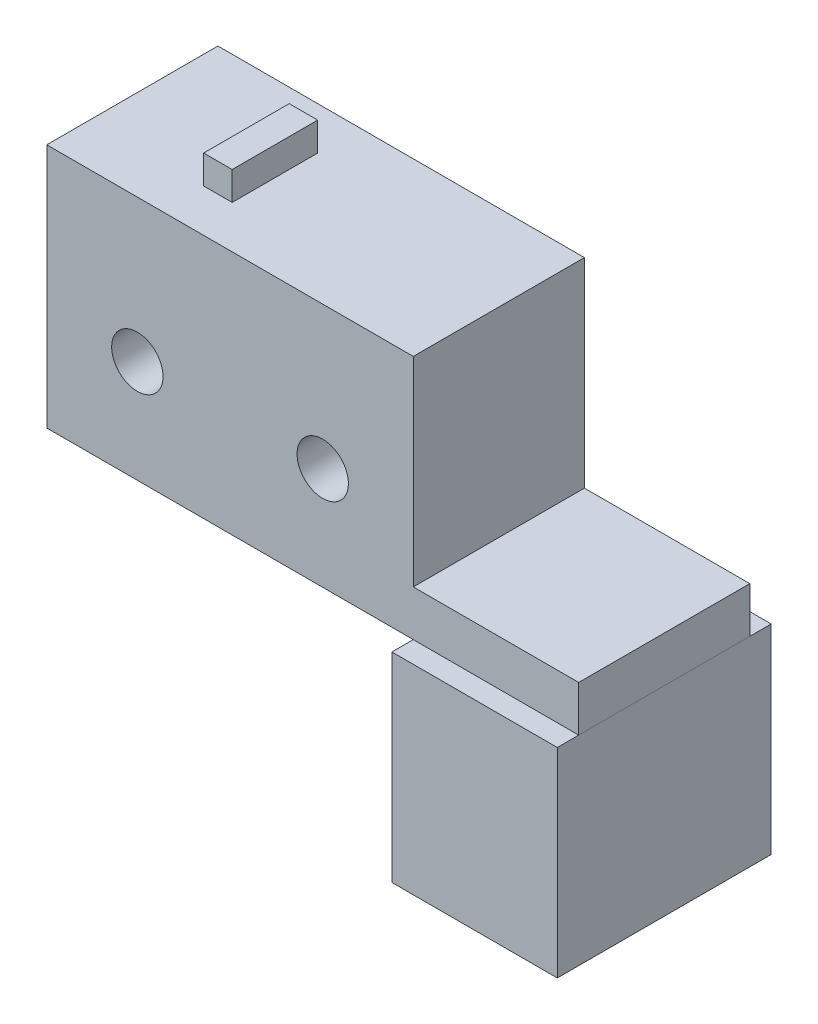
ISO-10303-21;
HEADER;
FILE_DESCRIPTION(('STEP AP214'),'2;1');
FILE_NAME('part.step','',(''),(''),'','','');
FILE_SCHEMA(('AUTOMOTIVE_DESIGN { 1 0 10303 214 1 1 1 1 }'));
ENDSEC;
DATA;
#1=APPLICATION_CONTEXT('core data for automotive mechanical design processes');
#2=APPLICATION_PROTOCOL_DEFINITION('international standard','automotive_design',2000,#1);
#3=PRODUCT_CONTEXT('',#1,'mechanical');
#4=PRODUCT('Part','Part','',(#3));
#5=PRODUCT_RELATED_PRODUCT_CATEGORY('part','',(#4));
#6=PRODUCT_DEFINITION_FORMATION('','',#4);
#7=PRODUCT_DEFINITION_CONTEXT('part definition',#1,'design');
#8=PRODUCT_DEFINITION('design','',#6,#7);
#9=PRODUCT_DEFINITION_SHAPE('','',#8);
#10=(LENGTH_UNIT() NAMED_UNIT(*) SI_UNIT(.MILLI.,.METRE.));
#11=(NAMED_UNIT(*) PLANE_ANGLE_UNIT() SI_UNIT($,.RADIAN.));
#12=(NAMED_UNIT(*) SI_UNIT($,.STERADIAN.) SOLID_ANGLE_UNIT());
#13=UNCERTAINTY_MEASURE_WITH_UNIT(LENGTH_MEASURE(1.E-05),#10,'distance_accuracy_value','');
#14=(GEOMETRIC_REPRESENTATION_CONTEXT(3) GLOBAL_UNCERTAINTY_ASSIGNED_CONTEXT((#13)) GLOBAL_UNIT_ASSIGNED_CONTEXT((#10,
#11,#12)) REPRESENTATION_CONTEXT('',''));
#15=CARTESIAN_POINT('',(0.,0.,0.));
#16=DIRECTION('',(0.,0.,1.));
#17=DIRECTION('',(1.,0.,0.));
#18=AXIS2_PLACEMENT_3D('',#15,#16,#17);
#19=CARTESIAN_POINT('',(12.8,4.4,8.35));
#20=DIRECTION('',(0.,0.,-1.));
#21=DIRECTION('',(-1.,0.,0.));
#22=AXIS2_PLACEMENT_3D('',#19,#20,#21);
#23=PLANE('',#22);
#24=DIRECTION('',(-1.,0.,0.));
#25=VECTOR('',#24,1.);
#26=CARTESIAN_POINT('',(12.8,11.4,8.35));
#27=LINE('',#26,#25);
#28=CARTESIAN_POINT('',(12.8,11.4,8.35));
#29=VERTEX_POINT('',#28);
#30=CARTESIAN_POINT('',(7.,11.4,8.35));
#31=VERTEX_POINT('',#30);
#32=EDGE_CURVE('E162',#29,#31,#27,.T.);
#33=ORIENTED_EDGE('',*,*,#32,.T.);
#34=DIRECTION('',(0.,1.,0.));
#35=VECTOR('',#34,1.);
#36=CARTESIAN_POINT('',(7.,4.4,8.35));
#37=LINE('',#36,#35);
#38=CARTESIAN_POINT('',(7.,4.4,8.35));
#39=VERTEX_POINT('',#38);
#40=EDGE_CURVE('E12',#39,#31,#37,.T.);
#41=ORIENTED_EDGE('',*,*,#40,.F.);
#42=DIRECTION('',(-1.,0.,0.));
#43=VECTOR('',#42,1.);
#44=CARTESIAN_POINT('',(12.8,4.4,8.35));
#45=LINE('',#44,#43);
#46=CARTESIAN_POINT('',(12.8,4.4,8.35));
#47=VERTEX_POINT('',#46);
#48=EDGE_CURVE('E155',#47,#39,#45,.T.);
#49=ORIENTED_EDGE('',*,*,#48,.F.);
#50=DIRECTION('',(0.,1.,0.));
#51=VECTOR('',#50,1.);
#52=CARTESIAN_POINT('',(12.8,4.4,8.35));
#53=LINE('',#52,#51);
#54=EDGE_CURVE('E161',#47,#29,#53,.T.);
#55=ORIENTED_EDGE('',*,*,#54,.T.);
#56=EDGE_LOOP('',(#33,#41,#49,#55));
#57=FACE_BOUND('',#56,.T.);
#58=ADVANCED_FACE('F48',(#57),#23,.F.);
#59=CARTESIAN_POINT('',(7.,4.4,8.35));
#60=DIRECTION('',(1.,0.,0.));
#61=DIRECTION('',(0.,0.,-1.));
#62=AXIS2_PLACEMENT_3D('',#59,#60,#61);
#63=PLANE('',#62);
#64=DIRECTION('',(0.,0.,-1.));
#65=VECTOR('',#64,1.);
#66=CARTESIAN_POINT('',(7.,11.4,8.35));
#67=LINE('',#66,#65);
#68=CARTESIAN_POINT('',(7.,11.4,0.849999999999999));
#69=VERTEX_POINT('',#68);
#70=EDGE_CURVE('E165',#31,#69,#67,.T.);
#71=ORIENTED_EDGE('',*,*,#70,.T.);
#72=DIRECTION('',(0.,1.,0.));
#73=VECTOR('',#72,1.);
#74=CARTESIAN_POINT('',(7.,4.4,0.849999999999999));
#75=LINE('',#74,#73);
#76=CARTESIAN_POINT('',(7.,4.4,0.849999999999999));
#77=VERTEX_POINT('',#76);
#78=EDGE_CURVE('E55',#77,#69,#75,.T.);
#79=ORIENTED_EDGE('',*,*,#78,.F.);
#80=DIRECTION('',(0.,0.,-1.));
#81=VECTOR('',#80,1.);
#82=CARTESIAN_POINT('',(7.,4.4,8.35));
#83=LINE('',#82,#81);
#84=EDGE_CURVE('E99',#39,#77,#83,.T.);
#85=ORIENTED_EDGE('',*,*,#84,.F.);
#86=ORIENTED_EDGE('',*,*,#40,.T.);
#87=EDGE_LOOP('',(#71,#79,#85,#86));
#88=FACE_BOUND('',#87,.T.);
#89=ADVANCED_FACE('F194',(#88),#63,.F.);
#90=CARTESIAN_POINT('',(7.,4.4,0.849999999999999));
#91=DIRECTION('',(0.,0.,1.));
#92=DIRECTION('',(1.,0.,0.));
#93=AXIS2_PLACEMENT_3D('',#90,#91,#92);
#94=PLANE('',#93);
#95=DIRECTION('',(1.,0.,0.));
#96=VECTOR('',#95,1.);
#97=CARTESIAN_POINT('',(7.,11.4,0.849999999999999));
#98=LINE('',#97,#96);
#99=CARTESIAN_POINT('',(12.8,11.4,0.849999999999999));
#100=VERTEX_POINT('',#99);
#101=EDGE_CURVE('E167',#69,#100,#98,.T.);
#102=ORIENTED_EDGE('',*,*,#101,.T.);
#103=DIRECTION('',(0.,1.,0.));
#104=VECTOR('',#103,1.);
#105=CARTESIAN_POINT('',(12.8,4.4,0.849999999999999));
#106=LINE('',#105,#104);
#107=CARTESIAN_POINT('',(12.8,4.4,0.849999999999999));
#108=VERTEX_POINT('',#107);
#109=EDGE_CURVE('E171',#108,#100,#106,.T.);
#110=ORIENTED_EDGE('',*,*,#109,.F.);
#111=DIRECTION('',(1.,0.,0.));
#112=VECTOR('',#111,1.);
#113=CARTESIAN_POINT('',(7.,4.4,0.849999999999999));
#114=LINE('',#113,#112);
#115=EDGE_CURVE('E158',#77,#108,#114,.T.);
#116=ORIENTED_EDGE('',*,*,#115,.F.);
#117=ORIENTED_EDGE('',*,*,#78,.T.);
#118=EDGE_LOOP('',(#102,#110,#116,#117));
#119=FACE_BOUND('',#118,.T.);
#120=ADVANCED_FACE('F176',(#119),#94,.F.);
#121=CARTESIAN_POINT('',(12.8,4.4,0.849999999999999));
#122=DIRECTION('',(-1.,0.,0.));
#123=DIRECTION('',(0.,0.,1.));
#124=AXIS2_PLACEMENT_3D('',#121,#122,#123);
#125=PLANE('',#124);
#126=DIRECTION('',(0.,0.,1.));
#127=VECTOR('',#126,1.);
#128=CARTESIAN_POINT('',(12.8,11.4,0.849999999999999));
#129=LINE('',#128,#127);
#130=EDGE_CURVE('E92',#100,#29,#129,.T.);
#131=ORIENTED_EDGE('',*,*,#130,.T.);
#132=ORIENTED_EDGE('',*,*,#54,.F.);
#133=DIRECTION('',(0.,0.,1.));
#134=VECTOR('',#133,1.);
#135=CARTESIAN_POINT('',(12.8,4.4,0.849999999999999));
#136=LINE('',#135,#134);
#137=EDGE_CURVE('E71',#108,#47,#136,.T.);
#138=ORIENTED_EDGE('',*,*,#137,.F.);
#139=ORIENTED_EDGE('',*,*,#109,.T.);
#140=EDGE_LOOP('',(#131,#132,#138,#139));
#141=FACE_BOUND('',#140,.T.);
#142=ADVANCED_FACE('F184',(#141),#125,.F.);
#143=CARTESIAN_POINT('',(0.,4.4,0.));
#144=DIRECTION('',(0.,-1.,0.));
#145=DIRECTION('',(0.,0.,-1.));
#146=AXIS2_PLACEMENT_3D('',#143,#144,#145);
#147=PLANE('',#146);
#148=DIRECTION('',(-1.,0.,0.));
#149=VECTOR('',#148,1.);
#150=CARTESIAN_POINT('',(12.8,4.4,7.85));
#151=LINE('',#150,#149);
#152=CARTESIAN_POINT('',(12.3,4.4,7.85));
#153=VERTEX_POINT('',#152);
#154=CARTESIAN_POINT('',(7.5,4.4,7.85));
#155=VERTEX_POINT('',#154);
#156=EDGE_CURVE('E144',#153,#155,#151,.T.);
#157=ORIENTED_EDGE('',*,*,#156,.F.);
#158=DIRECTION('',(0.,0.,1.));
#159=VECTOR('',#158,1.);
#160=CARTESIAN_POINT('',(12.3,4.4,0.849999999999999));
#161=LINE('',#160,#159);
#162=CARTESIAN_POINT('',(12.3,4.4,1.35));
#163=VERTEX_POINT('',#162);
#164=EDGE_CURVE('E153',#163,#153,#161,.T.);
#165=ORIENTED_EDGE('',*,*,#164,.F.);
#166=DIRECTION('',(1.,0.,0.));
#167=VECTOR('',#166,1.);
#168=CARTESIAN_POINT('',(7.,4.4,1.35));
#169=LINE('',#168,#167);
#170=CARTESIAN_POINT('',(7.5,4.4,1.35));
#171=VERTEX_POINT('',#170);
#172=EDGE_CURVE('E151',#171,#163,#169,.T.);
#173=ORIENTED_EDGE('',*,*,#172,.F.);
#174=DIRECTION('',(0.,0.,-1.));
#175=VECTOR('',#174,1.);
#176=CARTESIAN_POINT('',(7.5,4.4,8.35));
#177=LINE('',#176,#175);
#178=EDGE_CURVE('E136',#155,#171,#177,.T.);
#179=ORIENTED_EDGE('',*,*,#178,.F.);
#180=EDGE_LOOP('',(#157,#165,#173,#179));
#181=FACE_BOUND('',#180,.T.);
#182=ORIENTED_EDGE('',*,*,#48,.T.);
#183=ORIENTED_EDGE('',*,*,#84,.T.);
#184=ORIENTED_EDGE('',*,*,#115,.T.);
#185=ORIENTED_EDGE('',*,*,#137,.T.);
#186=EDGE_LOOP('',(#182,#183,#184,#185));
#187=FACE_BOUND('',#186,.T.);
#188=ADVANCED_FACE('F186',(#181,#187),#147,.T.);
#189=CARTESIAN_POINT('',(0.,11.4,0.));
#190=DIRECTION('',(0.,-1.,0.));
#191=DIRECTION('',(0.,0.,-1.));
#192=AXIS2_PLACEMENT_3D('',#189,#190,#191);
#193=PLANE('',#192);
#194=ORIENTED_EDGE('',*,*,#32,.F.);
#195=ORIENTED_EDGE('',*,*,#130,.F.);
#196=ORIENTED_EDGE('',*,*,#101,.F.);
#197=ORIENTED_EDGE('',*,*,#70,.F.);
#198=EDGE_LOOP('',(#194,#195,#196,#197));
#199=FACE_BOUND('',#198,.T.);
#200=ADVANCED_FACE('F180',(#199),#193,.F.);
#201=CARTESIAN_POINT('',(12.8,4.4,7.85));
#202=DIRECTION('',(0.,0.,-1.));
#203=DIRECTION('',(-1.,0.,0.));
#204=AXIS2_PLACEMENT_3D('',#201,#202,#203);
#205=PLANE('',#204);
#206=DIRECTION('',(-1.,0.,0.));
#207=VECTOR('',#206,1.);
#208=CARTESIAN_POINT('',(12.8,10.9,7.85));
#209=LINE('',#208,#207);
#210=CARTESIAN_POINT('',(12.3,10.9,7.85));
#211=VERTEX_POINT('',#210);
#212=CARTESIAN_POINT('',(7.5,10.9,7.85));
#213=VERTEX_POINT('',#212);
#214=EDGE_CURVE('E127',#211,#213,#209,.T.);
#215=ORIENTED_EDGE('',*,*,#214,.F.);
#216=DIRECTION('',(0.,1.,0.));
#217=VECTOR('',#216,1.);
#218=CARTESIAN_POINT('',(12.3,4.4,7.85));
#219=LINE('',#218,#217);
#220=EDGE_CURVE('E147',#153,#211,#219,.T.);
#221=ORIENTED_EDGE('',*,*,#220,.F.);
#222=ORIENTED_EDGE('',*,*,#156,.T.);
#223=DIRECTION('',(0.,1.,0.));
#224=VECTOR('',#223,1.);
#225=CARTESIAN_POINT('',(7.5,4.4,7.85));
#226=LINE('',#225,#224);
#227=EDGE_CURVE('E139',#155,#213,#226,.T.);
#228=ORIENTED_EDGE('',*,*,#227,.T.);
#229=EDGE_LOOP('',(#215,#221,#222,#228));
#230=FACE_BOUND('',#229,.T.);
#231=ADVANCED_FACE('F221',(#230),#205,.T.);
#232=CARTESIAN_POINT('',(7.5,4.4,8.35));
#233=DIRECTION('',(1.,0.,0.));
#234=DIRECTION('',(0.,0.,-1.));
#235=AXIS2_PLACEMENT_3D('',#232,#233,#234);
#236=PLANE('',#235);
#237=DIRECTION('',(0.,0.,-1.));
#238=VECTOR('',#237,1.);
#239=CARTESIAN_POINT('',(7.5,10.9,8.35));
#240=LINE('',#239,#238);
#241=CARTESIAN_POINT('',(7.5,10.9,1.35));
#242=VERTEX_POINT('',#241);
#243=EDGE_CURVE('E121',#213,#242,#240,.T.);
#244=ORIENTED_EDGE('',*,*,#243,.F.);
#245=ORIENTED_EDGE('',*,*,#227,.F.);
#246=ORIENTED_EDGE('',*,*,#178,.T.);
#247=DIRECTION('',(0.,1.,0.));
#248=VECTOR('',#247,1.);
#249=CARTESIAN_POINT('',(7.5,4.4,1.35));
#250=LINE('',#249,#248);
#251=EDGE_CURVE('E133',#171,#242,#250,.T.);
#252=ORIENTED_EDGE('',*,*,#251,.T.);
#253=EDGE_LOOP('',(#244,#245,#246,#252));
#254=FACE_BOUND('',#253,.T.);
#255=ADVANCED_FACE('F134',(#254),#236,.T.);
#256=CARTESIAN_POINT('',(7.,4.4,1.35));
#257=DIRECTION('',(0.,0.,1.));
#258=DIRECTION('',(1.,0.,0.));
#259=AXIS2_PLACEMENT_3D('',#256,#257,#258);
#260=PLANE('',#259);
#261=DIRECTION('',(1.,0.,0.));
#262=VECTOR('',#261,1.);
#263=CARTESIAN_POINT('',(7.,10.9,1.35));
#264=LINE('',#263,#262);
#265=CARTESIAN_POINT('',(12.3,10.9,1.35));
#266=VERTEX_POINT('',#265);
#267=EDGE_CURVE('E125',#242,#266,#264,.T.);
#268=ORIENTED_EDGE('',*,*,#267,.F.);
#269=ORIENTED_EDGE('',*,*,#251,.F.);
#270=ORIENTED_EDGE('',*,*,#172,.T.);
#271=DIRECTION('',(0.,1.,0.));
#272=VECTOR('',#271,1.);
#273=CARTESIAN_POINT('',(12.3,4.4,1.35));
#274=LINE('',#273,#272);
#275=EDGE_CURVE('E62',#163,#266,#274,.T.);
#276=ORIENTED_EDGE('',*,*,#275,.T.);
#277=EDGE_LOOP('',(#268,#269,#270,#276));
#278=FACE_BOUND('',#277,.T.);
#279=ADVANCED_FACE('F141',(#278),#260,.T.);
#280=CARTESIAN_POINT('',(12.3,4.4,0.849999999999999));
#281=DIRECTION('',(-1.,0.,0.));
#282=DIRECTION('',(0.,0.,1.));
#283=AXIS2_PLACEMENT_3D('',#280,#281,#282);
#284=PLANE('',#283);
#285=DIRECTION('',(0.,0.,1.));
#286=VECTOR('',#285,1.);
#287=CARTESIAN_POINT('',(12.3,10.9,0.849999999999999));
#288=LINE('',#287,#286);
#289=EDGE_CURVE('E142',#266,#211,#288,.T.);
#290=ORIENTED_EDGE('',*,*,#289,.F.);
#291=ORIENTED_EDGE('',*,*,#275,.F.);
#292=ORIENTED_EDGE('',*,*,#164,.T.);
#293=ORIENTED_EDGE('',*,*,#220,.T.);
#294=EDGE_LOOP('',(#290,#291,#292,#293));
#295=FACE_BOUND('',#294,.T.);
#296=ADVANCED_FACE('F251',(#295),#284,.T.);
#297=CARTESIAN_POINT('',(0.,10.9,0.));
#298=DIRECTION('',(0.,-1.,0.));
#299=DIRECTION('',(0.,0.,-1.));
#300=AXIS2_PLACEMENT_3D('',#297,#298,#299);
#301=PLANE('',#300);
#302=ORIENTED_EDGE('',*,*,#214,.T.);
#303=ORIENTED_EDGE('',*,*,#243,.T.);
#304=ORIENTED_EDGE('',*,*,#267,.T.);
#305=ORIENTED_EDGE('',*,*,#289,.T.);
#306=EDGE_LOOP('',(#302,#303,#304,#305));
#307=FACE_BOUND('',#306,.T.);
#308=ADVANCED_FACE('F123',(#307),#301,.T.);
#309=CLOSED_SHELL('',(#58,#89,#120,#142,#188,#200,#231,#255,#279,#296,#308));
#310=MANIFOLD_SOLID_BREP('B2',#309);
#311=CARTESIAN_POINT('',(-7.,20.,1.6));
#312=DIRECTION('',(0.,-1.,0.));
#313=DIRECTION('',(0.,0.,-1.));
#314=AXIS2_PLACEMENT_3D('',#311,#312,#313);
#315=PLANE('',#314);
#316=DIRECTION('',(0.,0.,-1.));
#317=VECTOR('',#316,1.);
#318=CARTESIAN_POINT('',(7.,20.,7.6));
#319=LINE('',#318,#317);
#320=CARTESIAN_POINT('',(7.,20.,7.6));
#321=VERTEX_POINT('',#320);
#322=CARTESIAN_POINT('',(7.,20.,1.6));
#323=VERTEX_POINT('',#322);
#324=EDGE_CURVE('E589',#321,#323,#319,.T.);
#325=ORIENTED_EDGE('',*,*,#324,.T.);
#326=DIRECTION('',(-1.,0.,0.));
#327=VECTOR('',#326,1.);
#328=CARTESIAN_POINT('',(-7.,20.,1.6));
#329=LINE('',#328,#327);
#330=CARTESIAN_POINT('',(-5.84999999999999,20.,1.6));
#331=VERTEX_POINT('',#330);
#332=EDGE_CURVE('E533',#323,#331,#329,.T.);
#333=ORIENTED_EDGE('',*,*,#332,.T.);
#334=DIRECTION('',(0.,0.,-1.));
#335=VECTOR('',#334,1.);
#336=CARTESIAN_POINT('',(-5.84999999999999,20.,7.6));
#337=LINE('',#336,#335);
#338=CARTESIAN_POINT('',(-5.84999999999999,20.,7.6));
#339=VERTEX_POINT('',#338);
#340=EDGE_CURVE('E594',#339,#331,#337,.T.);
#341=ORIENTED_EDGE('',*,*,#340,.F.);
#342=DIRECTION('',(-1.,0.,0.));
#343=VECTOR('',#342,1.);
#344=CARTESIAN_POINT('',(0.,20.,7.6));
#345=LINE('',#344,#343);
#346=EDGE_CURVE('E581',#321,#339,#345,.T.);
#347=ORIENTED_EDGE('',*,*,#346,.F.);
#348=EDGE_LOOP('',(#325,#333,#341,#347));
#349=FACE_BOUND('',#348,.T.);
#350=DIRECTION('',(-1.,0.,0.));
#351=VECTOR('',#350,1.);
#352=CARTESIAN_POINT('',(-0.849999999999986,20.,3.1));
#353=LINE('',#352,#351);
#354=CARTESIAN_POINT('',(-0.849999999999986,20.,3.1));
#355=VERTEX_POINT('',#354);
#356=CARTESIAN_POINT('',(-1.84999999999999,20.,3.1));
#357=VERTEX_POINT('',#356);
#358=EDGE_CURVE('E454',#355,#357,#353,.T.);
#359=ORIENTED_EDGE('',*,*,#358,.F.);
#360=DIRECTION('',(0.,0.,-1.));
#361=VECTOR('',#360,1.);
#362=CARTESIAN_POINT('',(-0.849999999999986,20.,6.1));
#363=LINE('',#362,#361);
#364=CARTESIAN_POINT('',(-0.849999999999987,20.,6.1));
#365=VERTEX_POINT('',#364);
#366=EDGE_CURVE('E451',#365,#355,#363,.T.);
#367=ORIENTED_EDGE('',*,*,#366,.F.);
#368=DIRECTION('',(1.,0.,0.));
#369=VECTOR('',#368,1.);
#370=CARTESIAN_POINT('',(-1.84999999999999,20.,6.1));
#371=LINE('',#370,#369);
#372=CARTESIAN_POINT('',(-1.84999999999999,20.,6.1));
#373=VERTEX_POINT('',#372);
#374=EDGE_CURVE('E305',#373,#365,#371,.T.);
#375=ORIENTED_EDGE('',*,*,#374,.F.);
#376=DIRECTION('',(0.,0.,1.));
#377=VECTOR('',#376,1.);
#378=CARTESIAN_POINT('',(-1.84999999999999,20.,3.1));
#379=LINE('',#378,#377);
#380=EDGE_CURVE('E300',#357,#373,#379,.T.);
#381=ORIENTED_EDGE('',*,*,#380,.F.);
#382=EDGE_LOOP('',(#359,#367,#375,#381));
#383=FACE_BOUND('',#382,.T.);
#384=ADVANCED_FACE('F286',(#349,#383),#315,.F.);
#385=CARTESIAN_POINT('',(7.,0.,7.6));
#386=DIRECTION('',(1.,0.,0.));
#387=DIRECTION('',(0.,1.,0.));
#388=AXIS2_PLACEMENT_3D('',#385,#386,#387);
#389=PLANE('',#388);
#390=DIRECTION('',(0.,0.,1.));
#391=VECTOR('',#390,1.);
#392=CARTESIAN_POINT('',(7.,13.,4.6));
#393=LINE('',#392,#391);
#394=CARTESIAN_POINT('',(7.00000000000001,13.,1.6));
#395=VERTEX_POINT('',#394);
#396=CARTESIAN_POINT('',(7.00000000000002,13.,7.6));
#397=VERTEX_POINT('',#396);
#398=EDGE_CURVE('E578',#395,#397,#393,.T.);
#399=ORIENTED_EDGE('',*,*,#398,.F.);
#400=DIRECTION('',(0.,-1.,0.));
#401=VECTOR('',#400,1.);
#402=CARTESIAN_POINT('',(7.,0.,1.6));
#403=LINE('',#402,#401);
#404=EDGE_CURVE('E584',#323,#395,#403,.T.);
#405=ORIENTED_EDGE('',*,*,#404,.F.);
#406=ORIENTED_EDGE('',*,*,#324,.F.);
#407=DIRECTION('',(0.,-1.,0.));
#408=VECTOR('',#407,1.);
#409=CARTESIAN_POINT('',(7.,0.,7.6));
#410=LINE('',#409,#408);
#411=EDGE_CURVE('E586',#321,#397,#410,.T.);
#412=ORIENTED_EDGE('',*,*,#411,.T.);
#413=EDGE_LOOP('',(#399,#405,#406,#412));
#414=FACE_BOUND('',#413,.T.);
#415=ADVANCED_FACE('F628',(#414),#389,.T.);
#416=CARTESIAN_POINT('',(0.,0.,7.6));
#417=DIRECTION('',(0.,0.,1.));
#418=DIRECTION('',(1.,0.,0.));
#419=AXIS2_PLACEMENT_3D('',#416,#417,#418);
#420=PLANE('',#419);
#421=CARTESIAN_POINT('',(3.82500000000001,15.,7.6));
#422=DIRECTION('',(0.,0.,1.));
#423=DIRECTION('',(1.,0.,0.));
#424=AXIS2_PLACEMENT_3D('',#421,#422,#423);
#425=CIRCLE('',#424,0.899999999999999);
#426=CARTESIAN_POINT('',(4.725,15.,7.6));
#427=VERTEX_POINT('',#426);
#428=EDGE_CURVE('E510',#427,#427,#425,.T.);
#429=ORIENTED_EDGE('',*,*,#428,.F.);
#430=EDGE_LOOP('',(#429));
#431=FACE_BOUND('',#430,.T.);
#432=CARTESIAN_POINT('',(-2.67499999999999,15.,7.6));
#433=DIRECTION('',(0.,0.,1.));
#434=DIRECTION('',(1.,0.,0.));
#435=AXIS2_PLACEMENT_3D('',#432,#433,#434);
#436=CIRCLE('',#435,0.9);
#437=CARTESIAN_POINT('',(-1.77499999999999,15.,7.6));
#438=VERTEX_POINT('',#437);
#439=EDGE_CURVE('E514',#438,#438,#436,.T.);
#440=ORIENTED_EDGE('',*,*,#439,.F.);
#441=EDGE_LOOP('',(#440));
#442=FACE_BOUND('',#441,.T.);
#443=ORIENTED_EDGE('',*,*,#346,.T.);
#444=DIRECTION('',(0.,-1.,0.));
#445=VECTOR('',#444,1.);
#446=CARTESIAN_POINT('',(-5.84999999999999,0.,7.6));
#447=LINE('',#446,#445);
#448=CARTESIAN_POINT('',(-5.84999999999999,11.4,7.6));
#449=VERTEX_POINT('',#448);
#450=EDGE_CURVE('E583',#339,#449,#447,.T.);
#451=ORIENTED_EDGE('',*,*,#450,.T.);
#452=DIRECTION('',(-1.,0.,0.));
#453=VECTOR('',#452,1.);
#454=CARTESIAN_POINT('',(-5.84999999999999,11.4,7.6));
#455=LINE('',#454,#453);
#456=CARTESIAN_POINT('',(12.8,11.4,7.6));
#457=VERTEX_POINT('',#456);
#458=EDGE_CURVE('E464',#457,#449,#455,.T.);
#459=ORIENTED_EDGE('',*,*,#458,.F.);
#460=DIRECTION('',(0.,1.,0.));
#461=VECTOR('',#460,1.);
#462=CARTESIAN_POINT('',(12.8,11.4,7.6));
#463=LINE('',#462,#461);
#464=CARTESIAN_POINT('',(12.8,13.,7.6));
#465=VERTEX_POINT('',#464);
#466=EDGE_CURVE('E474',#457,#465,#463,.T.);
#467=ORIENTED_EDGE('',*,*,#466,.T.);
#468=DIRECTION('',(-1.,0.,0.));
#469=VECTOR('',#468,1.);
#470=CARTESIAN_POINT('',(-5.84999999999999,13.,7.6));
#471=LINE('',#470,#469);
#472=EDGE_CURVE('E455',#465,#397,#471,.T.);
#473=ORIENTED_EDGE('',*,*,#472,.T.);
#474=ORIENTED_EDGE('',*,*,#411,.F.);
#475=EDGE_LOOP('',(#443,#451,#459,#467,#473,#474));
#476=FACE_BOUND('',#475,.T.);
#477=ADVANCED_FACE('F633',(#431,#442,#476),#420,.T.);
#478=CARTESIAN_POINT('',(-5.84999999999999,0.,7.6));
#479=DIRECTION('',(1.,0.,0.));
#480=DIRECTION('',(0.,0.,-1.));
#481=AXIS2_PLACEMENT_3D('',#478,#479,#480);
#482=PLANE('',#481);
#483=DIRECTION('',(0.,-1.,0.));
#484=VECTOR('',#483,1.);
#485=CARTESIAN_POINT('',(-5.84999999999999,10.,4.6));
#486=LINE('',#485,#484);
#487=CARTESIAN_POINT('',(-5.84999999999999,11.4,4.6));
#488=VERTEX_POINT('',#487);
#489=CARTESIAN_POINT('',(-5.84999999999999,10.75,4.6));
#490=VERTEX_POINT('',#489);
#491=EDGE_CURVE('E573',#488,#490,#486,.T.);
#492=ORIENTED_EDGE('',*,*,#491,.F.);
#493=DIRECTION('',(0.,0.,-1.));
#494=VECTOR('',#493,1.);
#495=CARTESIAN_POINT('',(-5.84999999999999,11.4,1.6));
#496=LINE('',#495,#494);
#497=EDGE_CURVE('E469',#449,#488,#496,.T.);
#498=ORIENTED_EDGE('',*,*,#497,.F.);
#499=ORIENTED_EDGE('',*,*,#450,.F.);
#500=ORIENTED_EDGE('',*,*,#340,.T.);
#501=DIRECTION('',(0.,-1.,0.));
#502=VECTOR('',#501,1.);
#503=CARTESIAN_POINT('',(-5.84999999999999,0.,1.6));
#504=LINE('',#503,#502);
#505=CARTESIAN_POINT('',(-5.84999999999999,11.4,1.6));
#506=VERTEX_POINT('',#505);
#507=EDGE_CURVE('E580',#331,#506,#504,.T.);
#508=ORIENTED_EDGE('',*,*,#507,.T.);
#509=CARTESIAN_POINT('',(-5.84999999999999,11.4,3.85));
#510=VERTEX_POINT('',#509);
#511=EDGE_CURVE('E467',#510,#506,#496,.T.);
#512=ORIENTED_EDGE('',*,*,#511,.F.);
#513=DIRECTION('',(0.,-1.,0.));
#514=VECTOR('',#513,1.);
#515=CARTESIAN_POINT('',(-5.84999999999999,0.,3.85));
#516=LINE('',#515,#514);
#517=CARTESIAN_POINT('',(-5.84999999999999,10.75,3.85));
#518=VERTEX_POINT('',#517);
#519=EDGE_CURVE('E563',#510,#518,#516,.T.);
#520=ORIENTED_EDGE('',*,*,#519,.T.);
#521=DIRECTION('',(0.,0.,1.));
#522=VECTOR('',#521,1.);
#523=CARTESIAN_POINT('',(-5.84999999999999,10.75,7.6));
#524=LINE('',#523,#522);
#525=EDGE_CURVE('E520',#518,#490,#524,.T.);
#526=ORIENTED_EDGE('',*,*,#525,.T.);
#527=EDGE_LOOP('',(#492,#498,#499,#500,#508,#512,#520,#526));
#528=FACE_BOUND('',#527,.T.);
#529=ADVANCED_FACE('F695',(#528),#482,.F.);
#530=CARTESIAN_POINT('',(-5.84999999999999,13.,4.6));
#531=DIRECTION('',(0.,0.,-1.));
#532=DIRECTION('',(-1.,0.,0.));
#533=AXIS2_PLACEMENT_3D('',#530,#531,#532);
#534=PLANE('',#533);
#535=DIRECTION('',(0.,-1.,0.));
#536=VECTOR('',#535,1.);
#537=CARTESIAN_POINT('',(-3.84999999999999,0.,4.6));
#538=LINE('',#537,#536);
#539=CARTESIAN_POINT('',(-3.84999999999999,11.4,4.6));
#540=VERTEX_POINT('',#539);
#541=CARTESIAN_POINT('',(-3.84999999999999,10.75,4.6));
#542=VERTEX_POINT('',#541);
#543=EDGE_CURVE('E567',#540,#542,#538,.T.);
#544=ORIENTED_EDGE('',*,*,#543,.F.);
#545=DIRECTION('',(-1.,0.,0.));
#546=VECTOR('',#545,1.);
#547=CARTESIAN_POINT('',(-5.84999999999999,11.4,4.6));
#548=LINE('',#547,#546);
#549=EDGE_CURVE('E507',#540,#488,#548,.T.);
#550=ORIENTED_EDGE('',*,*,#549,.T.);
#551=ORIENTED_EDGE('',*,*,#491,.T.);
#552=DIRECTION('',(1.,0.,0.));
#553=VECTOR('',#552,1.);
#554=CARTESIAN_POINT('',(-5.84999999999999,10.75,4.6));
#555=LINE('',#554,#553);
#556=EDGE_CURVE('E536',#490,#542,#555,.T.);
#557=ORIENTED_EDGE('',*,*,#556,.T.);
#558=EDGE_LOOP('',(#544,#550,#551,#557));
#559=FACE_BOUND('',#558,.T.);
#560=ADVANCED_FACE('F730',(#559),#534,.F.);
#561=CARTESIAN_POINT('',(-3.84999999999999,0.,1.6));
#562=DIRECTION('',(-1.,0.,0.));
#563=DIRECTION('',(0.,-1.,0.));
#564=AXIS2_PLACEMENT_3D('',#561,#562,#563);
#565=PLANE('',#564);
#566=DIRECTION('',(0.,1.,0.));
#567=VECTOR('',#566,1.);
#568=CARTESIAN_POINT('',(-3.84999999999999,0.,3.85));
#569=LINE('',#568,#567);
#570=CARTESIAN_POINT('',(-3.84999999999999,10.75,3.85));
#571=VERTEX_POINT('',#570);
#572=CARTESIAN_POINT('',(-3.84999999999999,11.4,3.85));
#573=VERTEX_POINT('',#572);
#574=EDGE_CURVE('E293',#571,#573,#569,.T.);
#575=ORIENTED_EDGE('',*,*,#574,.T.);
#576=DIRECTION('',(0.,0.,1.));
#577=VECTOR('',#576,1.);
#578=CARTESIAN_POINT('',(-3.84999999999999,11.4,1.6));
#579=LINE('',#578,#577);
#580=EDGE_CURVE('E504',#573,#540,#579,.T.);
#581=ORIENTED_EDGE('',*,*,#580,.T.);
#582=ORIENTED_EDGE('',*,*,#543,.T.);
#583=DIRECTION('',(0.,0.,-1.));
#584=VECTOR('',#583,1.);
#585=CARTESIAN_POINT('',(-3.84999999999999,10.75,1.6));
#586=LINE('',#585,#584);
#587=EDGE_CURVE('E529',#542,#571,#586,.T.);
#588=ORIENTED_EDGE('',*,*,#587,.T.);
#589=EDGE_LOOP('',(#575,#581,#582,#588));
#590=FACE_BOUND('',#589,.T.);
#591=ADVANCED_FACE('F740',(#590),#565,.F.);
#592=CARTESIAN_POINT('',(-9.00000000000002,0.,3.85));
#593=DIRECTION('',(0.,0.,1.));
#594=DIRECTION('',(0.,-1.,0.));
#595=AXIS2_PLACEMENT_3D('',#592,#593,#594);
#596=PLANE('',#595);
#597=ORIENTED_EDGE('',*,*,#519,.F.);
#598=DIRECTION('',(1.,0.,0.));
#599=VECTOR('',#598,1.);
#600=CARTESIAN_POINT('',(-9.00000000000002,11.4,3.85));
#601=LINE('',#600,#599);
#602=EDGE_CURVE('E501',#510,#573,#601,.T.);
#603=ORIENTED_EDGE('',*,*,#602,.T.);
#604=ORIENTED_EDGE('',*,*,#574,.F.);
#605=DIRECTION('',(1.,0.,0.));
#606=VECTOR('',#605,1.);
#607=CARTESIAN_POINT('',(-9.00000000000001,10.75,3.85));
#608=LINE('',#607,#606);
#609=EDGE_CURVE('E553',#518,#571,#608,.T.);
#610=ORIENTED_EDGE('',*,*,#609,.F.);
#611=EDGE_LOOP('',(#597,#603,#604,#610));
#612=FACE_BOUND('',#611,.T.);
#613=ADVANCED_FACE('F705',(#612),#596,.F.);
#614=CARTESIAN_POINT('',(9.00000000000001,10.75,1.6));
#615=DIRECTION('',(0.,1.,0.));
#616=DIRECTION('',(-1.,0.,0.));
#617=AXIS2_PLACEMENT_3D('',#614,#615,#616);
#618=PLANE('',#617);
#619=ORIENTED_EDGE('',*,*,#556,.F.);
#620=ORIENTED_EDGE('',*,*,#525,.F.);
#621=ORIENTED_EDGE('',*,*,#609,.T.);
#622=ORIENTED_EDGE('',*,*,#587,.F.);
#623=EDGE_LOOP('',(#619,#620,#621,#622));
#624=FACE_BOUND('',#623,.T.);
#625=ADVANCED_FACE('F680',(#624),#618,.F.);
#626=CARTESIAN_POINT('',(9.00000000000001,18.,1.6));
#627=DIRECTION('',(0.,0.,1.));
#628=DIRECTION('',(1.,0.,0.));
#629=AXIS2_PLACEMENT_3D('',#626,#627,#628);
#630=PLANE('',#629);
#631=CARTESIAN_POINT('',(3.82500000000001,15.,1.6));
#632=DIRECTION('',(0.,0.,1.));
#633=DIRECTION('',(1.,0.,0.));
#634=AXIS2_PLACEMENT_3D('',#631,#632,#633);
#635=CIRCLE('',#634,0.899999999999999);
#636=CARTESIAN_POINT('',(4.725,15.,1.6));
#637=VERTEX_POINT('',#636);
#638=EDGE_CURVE('E513',#637,#637,#635,.T.);
#639=ORIENTED_EDGE('',*,*,#638,.T.);
#640=EDGE_LOOP('',(#639));
#641=FACE_BOUND('',#640,.T.);
#642=CARTESIAN_POINT('',(-2.67499999999999,15.,1.6));
#643=DIRECTION('',(0.,0.,1.));
#644=DIRECTION('',(1.,0.,0.));
#645=AXIS2_PLACEMENT_3D('',#642,#643,#644);
#646=CIRCLE('',#645,0.9);
#647=CARTESIAN_POINT('',(-1.77499999999999,15.,1.6));
#648=VERTEX_POINT('',#647);
#649=EDGE_CURVE('E517',#648,#648,#646,.T.);
#650=ORIENTED_EDGE('',*,*,#649,.T.);
#651=EDGE_LOOP('',(#650));
#652=FACE_BOUND('',#651,.T.);
#653=ORIENTED_EDGE('',*,*,#404,.T.);
#654=DIRECTION('',(1.,0.,0.));
#655=VECTOR('',#654,1.);
#656=CARTESIAN_POINT('',(12.8,13.,1.6));
#657=LINE('',#656,#655);
#658=CARTESIAN_POINT('',(12.8,13.,1.6));
#659=VERTEX_POINT('',#658);
#660=EDGE_CURVE('E458',#395,#659,#657,.T.);
#661=ORIENTED_EDGE('',*,*,#660,.T.);
#662=DIRECTION('',(0.,1.,0.));
#663=VECTOR('',#662,1.);
#664=CARTESIAN_POINT('',(12.8,11.4,1.6));
#665=LINE('',#664,#663);
#666=CARTESIAN_POINT('',(12.8,11.4,1.6));
#667=VERTEX_POINT('',#666);
#668=EDGE_CURVE('E480',#667,#659,#665,.T.);
#669=ORIENTED_EDGE('',*,*,#668,.F.);
#670=DIRECTION('',(1.,0.,0.));
#671=VECTOR('',#670,1.);
#672=CARTESIAN_POINT('',(12.8,11.4,1.6));
#673=LINE('',#672,#671);
#674=EDGE_CURVE('E471',#506,#667,#673,.T.);
#675=ORIENTED_EDGE('',*,*,#674,.F.);
#676=ORIENTED_EDGE('',*,*,#507,.F.);
#677=ORIENTED_EDGE('',*,*,#332,.F.);
#678=EDGE_LOOP('',(#653,#661,#669,#675,#676,#677));
#679=FACE_BOUND('',#678,.T.);
#680=ADVANCED_FACE('F608',(#641,#652,#679),#630,.F.);
#681=CARTESIAN_POINT('',(-2.67499999999999,15.,1.59995));
#682=DIRECTION('',(0.,0.,1.));
#683=DIRECTION('',(1.,0.,0.));
#684=AXIS2_PLACEMENT_3D('',#681,#682,#683);
#685=CYLINDRICAL_SURFACE('',#684,0.9);
#686=ORIENTED_EDGE('',*,*,#439,.T.);
#687=EDGE_LOOP('',(#686));
#688=FACE_BOUND('',#687,.T.);
#689=ORIENTED_EDGE('',*,*,#649,.F.);
#690=EDGE_LOOP('',(#689));
#691=FACE_BOUND('',#690,.T.);
#692=ADVANCED_FACE('F614',(#688,#691),#685,.F.);
#693=CARTESIAN_POINT('',(3.82500000000001,15.,1.59995));
#694=DIRECTION('',(0.,0.,1.));
#695=DIRECTION('',(1.,0.,0.));
#696=AXIS2_PLACEMENT_3D('',#693,#694,#695);
#697=CYLINDRICAL_SURFACE('',#696,0.899999999999999);
#698=ORIENTED_EDGE('',*,*,#428,.T.);
#699=EDGE_LOOP('',(#698));
#700=FACE_BOUND('',#699,.T.);
#701=ORIENTED_EDGE('',*,*,#638,.F.);
#702=EDGE_LOOP('',(#701));
#703=FACE_BOUND('',#702,.T.);
#704=ADVANCED_FACE('F611',(#700,#703),#697,.F.);
#705=CARTESIAN_POINT('',(0.,11.4,0.));
#706=DIRECTION('',(0.,-1.,0.));
#707=DIRECTION('',(0.,0.,-1.));
#708=AXIS2_PLACEMENT_3D('',#705,#706,#707);
#709=PLANE('',#708);
#710=DIRECTION('',(-1.,0.,0.));
#711=VECTOR('',#710,1.);
#712=CARTESIAN_POINT('',(-5.84999999999999,11.4,4.6));
#713=LINE('',#712,#711);
#714=CARTESIAN_POINT('',(1.575,11.4,4.6));
#715=VERTEX_POINT('',#714);
#716=CARTESIAN_POINT('',(-0.424999999999987,11.4,4.6));
#717=VERTEX_POINT('',#716);
#718=EDGE_CURVE('E498',#715,#717,#713,.T.);
#719=ORIENTED_EDGE('',*,*,#718,.F.);
#720=DIRECTION('',(0.,0.,1.));
#721=VECTOR('',#720,1.);
#722=CARTESIAN_POINT('',(1.575,11.4,1.6));
#723=LINE('',#722,#721);
#724=CARTESIAN_POINT('',(1.575,11.4,3.85));
#725=VERTEX_POINT('',#724);
#726=EDGE_CURVE('E495',#725,#715,#723,.T.);
#727=ORIENTED_EDGE('',*,*,#726,.F.);
#728=DIRECTION('',(1.,0.,0.));
#729=VECTOR('',#728,1.);
#730=CARTESIAN_POINT('',(-9.00000000000002,11.4,3.85));
#731=LINE('',#730,#729);
#732=CARTESIAN_POINT('',(-0.424999999999988,11.4,3.85));
#733=VERTEX_POINT('',#732);
#734=EDGE_CURVE('E490',#733,#725,#731,.T.);
#735=ORIENTED_EDGE('',*,*,#734,.F.);
#736=DIRECTION('',(0.,0.,1.));
#737=VECTOR('',#736,1.);
#738=CARTESIAN_POINT('',(-0.424999999999987,11.4,1.6));
#739=LINE('',#738,#737);
#740=EDGE_CURVE('E493',#733,#717,#739,.T.);
#741=ORIENTED_EDGE('',*,*,#740,.T.);
#742=EDGE_LOOP('',(#719,#727,#735,#741));
#743=FACE_BOUND('',#742,.T.);
#744=DIRECTION('',(-1.,0.,0.));
#745=VECTOR('',#744,1.);
#746=CARTESIAN_POINT('',(-5.84999999999999,11.4,4.6));
#747=LINE('',#746,#745);
#748=CARTESIAN_POINT('',(6.99999999999999,11.4,4.6));
#749=VERTEX_POINT('',#748);
#750=CARTESIAN_POINT('',(5.,11.4,4.6));
#751=VERTEX_POINT('',#750);
#752=EDGE_CURVE('E485',#749,#751,#747,.T.);
#753=ORIENTED_EDGE('',*,*,#752,.F.);
#754=DIRECTION('',(0.,0.,-1.));
#755=VECTOR('',#754,1.);
#756=CARTESIAN_POINT('',(7.,11.4,7.6));
#757=LINE('',#756,#755);
#758=CARTESIAN_POINT('',(7.00000000000002,11.4,3.85));
#759=VERTEX_POINT('',#758);
#760=EDGE_CURVE('E488',#749,#759,#757,.T.);
#761=ORIENTED_EDGE('',*,*,#760,.T.);
#762=DIRECTION('',(1.,0.,0.));
#763=VECTOR('',#762,1.);
#764=CARTESIAN_POINT('',(-9.00000000000002,11.4,3.85));
#765=LINE('',#764,#763);
#766=CARTESIAN_POINT('',(5.,11.4,3.85));
#767=VERTEX_POINT('',#766);
#768=EDGE_CURVE('E46',#767,#759,#765,.T.);
#769=ORIENTED_EDGE('',*,*,#768,.F.);
#770=DIRECTION('',(0.,0.,1.));
#771=VECTOR('',#770,1.);
#772=CARTESIAN_POINT('',(5.,11.4,1.6));
#773=LINE('',#772,#771);
#774=EDGE_CURVE('E483',#767,#751,#773,.T.);
#775=ORIENTED_EDGE('',*,*,#774,.T.);
#776=EDGE_LOOP('',(#753,#761,#769,#775));
#777=FACE_BOUND('',#776,.T.);
#778=ORIENTED_EDGE('',*,*,#549,.F.);
#779=ORIENTED_EDGE('',*,*,#580,.F.);
#780=ORIENTED_EDGE('',*,*,#602,.F.);
#781=ORIENTED_EDGE('',*,*,#511,.T.);
#782=ORIENTED_EDGE('',*,*,#674,.T.);
#783=DIRECTION('',(0.,0.,1.));
#784=VECTOR('',#783,1.);
#785=CARTESIAN_POINT('',(12.8,11.4,1.6));
#786=LINE('',#785,#784);
#787=EDGE_CURVE('E473',#667,#457,#786,.T.);
#788=ORIENTED_EDGE('',*,*,#787,.T.);
#789=ORIENTED_EDGE('',*,*,#458,.T.);
#790=ORIENTED_EDGE('',*,*,#497,.T.);
#791=EDGE_LOOP('',(#778,#779,#780,#781,#782,#788,#789,#790));
#792=FACE_BOUND('',#791,.T.);
#793=ADVANCED_FACE('F613',(#743,#777,#792),#709,.T.);
#794=CARTESIAN_POINT('',(0.,13.,0.));
#795=DIRECTION('',(0.,-1.,0.));
#796=DIRECTION('',(0.,0.,-1.));
#797=AXIS2_PLACEMENT_3D('',#794,#795,#796);
#798=PLANE('',#797);
#799=ORIENTED_EDGE('',*,*,#398,.T.);
#800=ORIENTED_EDGE('',*,*,#472,.F.);
#801=DIRECTION('',(0.,0.,1.));
#802=VECTOR('',#801,1.);
#803=CARTESIAN_POINT('',(12.8,13.,1.6));
#804=LINE('',#803,#802);
#805=EDGE_CURVE('E468',#659,#465,#804,.T.);
#806=ORIENTED_EDGE('',*,*,#805,.F.);
#807=ORIENTED_EDGE('',*,*,#660,.F.);
#808=EDGE_LOOP('',(#799,#800,#806,#807));
#809=FACE_BOUND('',#808,.T.);
#810=ADVANCED_FACE('F621',(#809),#798,.F.);
#811=CARTESIAN_POINT('',(12.8,11.4,1.6));
#812=DIRECTION('',(-1.,0.,0.));
#813=DIRECTION('',(0.,0.,1.));
#814=AXIS2_PLACEMENT_3D('',#811,#812,#813);
#815=PLANE('',#814);
#816=ORIENTED_EDGE('',*,*,#805,.T.);
#817=ORIENTED_EDGE('',*,*,#466,.F.);
#818=ORIENTED_EDGE('',*,*,#787,.F.);
#819=ORIENTED_EDGE('',*,*,#668,.T.);
#820=EDGE_LOOP('',(#816,#817,#818,#819));
#821=FACE_BOUND('',#820,.T.);
#822=ADVANCED_FACE('F668',(#821),#815,.F.);
#823=DIRECTION('',(0.,0.,-1.));
#824=VECTOR('',#823,1.);
#825=CARTESIAN_POINT('',(5.,10.75,1.6));
#826=LINE('',#825,#824);
#827=CARTESIAN_POINT('',(5.,10.75,4.6));
#828=VERTEX_POINT('',#827);
#829=CARTESIAN_POINT('',(5.,10.75,3.85));
#830=VERTEX_POINT('',#829);
#831=EDGE_CURVE('E518',#828,#830,#826,.T.);
#832=ORIENTED_EDGE('',*,*,#831,.T.);
#833=CARTESIAN_POINT('',(7.00000000000001,10.75,3.85));
#834=VERTEX_POINT('',#833);
#835=EDGE_CURVE('E549',#830,#834,#608,.T.);
#836=ORIENTED_EDGE('',*,*,#835,.T.);
#837=DIRECTION('',(0.,0.,1.));
#838=VECTOR('',#837,1.);
#839=CARTESIAN_POINT('',(7.,10.75,7.6));
#840=LINE('',#839,#838);
#841=CARTESIAN_POINT('',(7.,10.75,4.6));
#842=VERTEX_POINT('',#841);
#843=EDGE_CURVE('E522',#834,#842,#840,.T.);
#844=ORIENTED_EDGE('',*,*,#843,.T.);
#845=DIRECTION('',(1.,0.,0.));
#846=VECTOR('',#845,1.);
#847=CARTESIAN_POINT('',(-5.84999999999999,10.75,4.6));
#848=LINE('',#847,#846);
#849=EDGE_CURVE('E521',#828,#842,#848,.T.);
#850=ORIENTED_EDGE('',*,*,#849,.F.);
#851=EDGE_LOOP('',(#832,#836,#844,#850));
#852=FACE_BOUND('',#851,.T.);
#853=ADVANCED_FACE('F671',(#852),#618,.F.);
#854=DIRECTION('',(0.,1.,0.));
#855=VECTOR('',#854,1.);
#856=CARTESIAN_POINT('',(5.,0.,3.85));
#857=LINE('',#856,#855);
#858=EDGE_CURVE('E560',#830,#767,#857,.T.);
#859=ORIENTED_EDGE('',*,*,#858,.T.);
#860=ORIENTED_EDGE('',*,*,#768,.T.);
#861=DIRECTION('',(0.,-1.,0.));
#862=VECTOR('',#861,1.);
#863=CARTESIAN_POINT('',(7.,0.,3.85));
#864=LINE('',#863,#862);
#865=EDGE_CURVE('E547',#759,#834,#864,.T.);
#866=ORIENTED_EDGE('',*,*,#865,.T.);
#867=ORIENTED_EDGE('',*,*,#835,.F.);
#868=EDGE_LOOP('',(#859,#860,#866,#867));
#869=FACE_BOUND('',#868,.T.);
#870=ADVANCED_FACE('F676',(#869),#596,.F.);
#871=CARTESIAN_POINT('',(5.,0.,1.6));
#872=DIRECTION('',(-1.,0.,0.));
#873=DIRECTION('',(0.,0.,1.));
#874=AXIS2_PLACEMENT_3D('',#871,#872,#873);
#875=PLANE('',#874);
#876=ORIENTED_EDGE('',*,*,#774,.F.);
#877=ORIENTED_EDGE('',*,*,#858,.F.);
#878=ORIENTED_EDGE('',*,*,#831,.F.);
#879=DIRECTION('',(0.,-1.,0.));
#880=VECTOR('',#879,1.);
#881=CARTESIAN_POINT('',(5.,0.,4.6));
#882=LINE('',#881,#880);
#883=EDGE_CURVE('E571',#751,#828,#882,.T.);
#884=ORIENTED_EDGE('',*,*,#883,.F.);
#885=EDGE_LOOP('',(#876,#877,#878,#884));
#886=FACE_BOUND('',#885,.T.);
#887=ADVANCED_FACE('F737',(#886),#875,.T.);
#888=DIRECTION('',(0.,1.,0.));
#889=VECTOR('',#888,1.);
#890=CARTESIAN_POINT('',(7.,10.,4.6));
#891=LINE('',#890,#889);
#892=EDGE_CURVE('E575',#842,#749,#891,.T.);
#893=ORIENTED_EDGE('',*,*,#892,.T.);
#894=ORIENTED_EDGE('',*,*,#752,.T.);
#895=ORIENTED_EDGE('',*,*,#883,.T.);
#896=ORIENTED_EDGE('',*,*,#849,.T.);
#897=EDGE_LOOP('',(#893,#894,#895,#896));
#898=FACE_BOUND('',#897,.T.);
#899=ADVANCED_FACE('F729',(#898),#534,.F.);
#900=ORIENTED_EDGE('',*,*,#760,.F.);
#901=ORIENTED_EDGE('',*,*,#892,.F.);
#902=ORIENTED_EDGE('',*,*,#843,.F.);
#903=ORIENTED_EDGE('',*,*,#865,.F.);
#904=EDGE_LOOP('',(#900,#901,#902,#903));
#905=FACE_BOUND('',#904,.T.);
#906=ADVANCED_FACE('F636',(#905),#389,.T.);
#907=DIRECTION('',(1.,0.,0.));
#908=VECTOR('',#907,1.);
#909=CARTESIAN_POINT('',(-5.84999999999999,10.75,4.6));
#910=LINE('',#909,#908);
#911=CARTESIAN_POINT('',(-0.424999999999987,10.75,4.6));
#912=VERTEX_POINT('',#911);
#913=CARTESIAN_POINT('',(1.575,10.75,4.6));
#914=VERTEX_POINT('',#913);
#915=EDGE_CURVE('E528',#912,#914,#910,.T.);
#916=ORIENTED_EDGE('',*,*,#915,.F.);
#917=DIRECTION('',(0.,0.,-1.));
#918=VECTOR('',#917,1.);
#919=CARTESIAN_POINT('',(-0.424999999999987,10.75,1.6));
#920=LINE('',#919,#918);
#921=CARTESIAN_POINT('',(-0.424999999999987,10.75,3.85));
#922=VERTEX_POINT('',#921);
#923=EDGE_CURVE('E526',#912,#922,#920,.T.);
#924=ORIENTED_EDGE('',*,*,#923,.T.);
#925=CARTESIAN_POINT('',(1.575,10.75,3.85));
#926=VERTEX_POINT('',#925);
#927=EDGE_CURVE('E552',#922,#926,#608,.T.);
#928=ORIENTED_EDGE('',*,*,#927,.T.);
#929=DIRECTION('',(0.,0.,-1.));
#930=VECTOR('',#929,1.);
#931=CARTESIAN_POINT('',(1.575,10.75,1.6));
#932=LINE('',#931,#930);
#933=EDGE_CURVE('E530',#914,#926,#932,.T.);
#934=ORIENTED_EDGE('',*,*,#933,.F.);
#935=EDGE_LOOP('',(#916,#924,#928,#934));
#936=FACE_BOUND('',#935,.T.);
#937=ADVANCED_FACE('F679',(#936),#618,.F.);
#938=DIRECTION('',(0.,1.,0.));
#939=VECTOR('',#938,1.);
#940=CARTESIAN_POINT('',(-0.424999999999986,0.,3.85));
#941=LINE('',#940,#939);
#942=EDGE_CURVE('E554',#922,#733,#941,.T.);
#943=ORIENTED_EDGE('',*,*,#942,.T.);
#944=ORIENTED_EDGE('',*,*,#734,.T.);
#945=DIRECTION('',(0.,1.,0.));
#946=VECTOR('',#945,1.);
#947=CARTESIAN_POINT('',(1.575,0.,3.85));
#948=LINE('',#947,#946);
#949=EDGE_CURVE('E557',#926,#725,#948,.T.);
#950=ORIENTED_EDGE('',*,*,#949,.F.);
#951=ORIENTED_EDGE('',*,*,#927,.F.);
#952=EDGE_LOOP('',(#943,#944,#950,#951));
#953=FACE_BOUND('',#952,.T.);
#954=ADVANCED_FACE('F720',(#953),#596,.F.);
#955=CARTESIAN_POINT('',(-0.424999999999986,0.,1.6));
#956=DIRECTION('',(-1.,0.,0.));
#957=DIRECTION('',(0.,-1.,0.));
#958=AXIS2_PLACEMENT_3D('',#955,#956,#957);
#959=PLANE('',#958);
#960=ORIENTED_EDGE('',*,*,#740,.F.);
#961=ORIENTED_EDGE('',*,*,#942,.F.);
#962=ORIENTED_EDGE('',*,*,#923,.F.);
#963=DIRECTION('',(0.,-1.,0.));
#964=VECTOR('',#963,1.);
#965=CARTESIAN_POINT('',(-0.424999999999986,0.,4.6));
#966=LINE('',#965,#964);
#967=EDGE_CURVE('E565',#717,#912,#966,.T.);
#968=ORIENTED_EDGE('',*,*,#967,.F.);
#969=EDGE_LOOP('',(#960,#961,#962,#968));
#970=FACE_BOUND('',#969,.T.);
#971=ADVANCED_FACE('F725',(#970),#959,.T.);
#972=CARTESIAN_POINT('',(1.575,0.,1.6));
#973=DIRECTION('',(-1.,0.,0.));
#974=DIRECTION('',(0.,-1.,0.));
#975=AXIS2_PLACEMENT_3D('',#972,#973,#974);
#976=PLANE('',#975);
#977=ORIENTED_EDGE('',*,*,#949,.T.);
#978=ORIENTED_EDGE('',*,*,#726,.T.);
#979=DIRECTION('',(0.,-1.,0.));
#980=VECTOR('',#979,1.);
#981=CARTESIAN_POINT('',(1.575,0.,4.6));
#982=LINE('',#981,#980);
#983=EDGE_CURVE('E569',#715,#914,#982,.T.);
#984=ORIENTED_EDGE('',*,*,#983,.T.);
#985=ORIENTED_EDGE('',*,*,#933,.T.);
#986=EDGE_LOOP('',(#977,#978,#984,#985));
#987=FACE_BOUND('',#986,.T.);
#988=ADVANCED_FACE('F718',(#987),#976,.F.);
#989=ORIENTED_EDGE('',*,*,#983,.F.);
#990=ORIENTED_EDGE('',*,*,#718,.T.);
#991=ORIENTED_EDGE('',*,*,#967,.T.);
#992=ORIENTED_EDGE('',*,*,#915,.T.);
#993=EDGE_LOOP('',(#989,#990,#991,#992));
#994=FACE_BOUND('',#993,.T.);
#995=ADVANCED_FACE('F665',(#994),#534,.F.);
#996=CARTESIAN_POINT('',(-0.849999999999986,21.,3.1));
#997=DIRECTION('',(0.,0.,1.));
#998=DIRECTION('',(1.,0.,0.));
#999=AXIS2_PLACEMENT_3D('',#996,#997,#998);
#1000=PLANE('',#999);
#1001=ORIENTED_EDGE('',*,*,#358,.T.);
#1002=DIRECTION('',(0.,-1.,0.));
#1003=VECTOR('',#1002,1.);
#1004=CARTESIAN_POINT('',(-1.84999999999999,21.,3.1));
#1005=LINE('',#1004,#1003);
#1006=CARTESIAN_POINT('',(-1.84999999999999,21.,3.1));
#1007=VERTEX_POINT('',#1006);
#1008=EDGE_CURVE('E435',#1007,#357,#1005,.T.);
#1009=ORIENTED_EDGE('',*,*,#1008,.F.);
#1010=DIRECTION('',(-1.,0.,0.));
#1011=VECTOR('',#1010,1.);
#1012=CARTESIAN_POINT('',(-0.849999999999986,21.,3.1));
#1013=LINE('',#1012,#1011);
#1014=CARTESIAN_POINT('',(-0.849999999999986,21.,3.1));
#1015=VERTEX_POINT('',#1014);
#1016=EDGE_CURVE('E442',#1015,#1007,#1013,.T.);
#1017=ORIENTED_EDGE('',*,*,#1016,.F.);
#1018=DIRECTION('',(0.,-1.,0.));
#1019=VECTOR('',#1018,1.);
#1020=CARTESIAN_POINT('',(-0.849999999999986,21.,3.1));
#1021=LINE('',#1020,#1019);
#1022=EDGE_CURVE('E644',#1015,#355,#1021,.T.);
#1023=ORIENTED_EDGE('',*,*,#1022,.T.);
#1024=EDGE_LOOP('',(#1001,#1009,#1017,#1023));
#1025=FACE_BOUND('',#1024,.T.);
#1026=ADVANCED_FACE('F453',(#1025),#1000,.F.);
#1027=CARTESIAN_POINT('',(-1.84999999999999,21.,3.1));
#1028=DIRECTION('',(1.,0.,0.));
#1029=DIRECTION('',(0.,0.,-1.));
#1030=AXIS2_PLACEMENT_3D('',#1027,#1028,#1029);
#1031=PLANE('',#1030);
#1032=ORIENTED_EDGE('',*,*,#380,.T.);
#1033=DIRECTION('',(0.,-1.,0.));
#1034=VECTOR('',#1033,1.);
#1035=CARTESIAN_POINT('',(-1.84999999999999,21.,6.1));
#1036=LINE('',#1035,#1034);
#1037=CARTESIAN_POINT('',(-1.84999999999999,21.,6.1));
#1038=VERTEX_POINT('',#1037);
#1039=EDGE_CURVE('E438',#1038,#373,#1036,.T.);
#1040=ORIENTED_EDGE('',*,*,#1039,.F.);
#1041=DIRECTION('',(0.,0.,1.));
#1042=VECTOR('',#1041,1.);
#1043=CARTESIAN_POINT('',(-1.84999999999999,21.,3.1));
#1044=LINE('',#1043,#1042);
#1045=EDGE_CURVE('E431',#1007,#1038,#1044,.T.);
#1046=ORIENTED_EDGE('',*,*,#1045,.F.);
#1047=ORIENTED_EDGE('',*,*,#1008,.T.);
#1048=EDGE_LOOP('',(#1032,#1040,#1046,#1047));
#1049=FACE_BOUND('',#1048,.T.);
#1050=ADVANCED_FACE('F433',(#1049),#1031,.F.);
#1051=CARTESIAN_POINT('',(-1.84999999999999,21.,6.1));
#1052=DIRECTION('',(0.,0.,-1.));
#1053=DIRECTION('',(-1.,0.,0.));
#1054=AXIS2_PLACEMENT_3D('',#1051,#1052,#1053);
#1055=PLANE('',#1054);
#1056=ORIENTED_EDGE('',*,*,#374,.T.);
#1057=DIRECTION('',(0.,-1.,0.));
#1058=VECTOR('',#1057,1.);
#1059=CARTESIAN_POINT('',(-0.849999999999986,21.,6.1));
#1060=LINE('',#1059,#1058);
#1061=CARTESIAN_POINT('',(-0.849999999999986,21.,6.1));
#1062=VERTEX_POINT('',#1061);
#1063=EDGE_CURVE('E460',#1062,#365,#1060,.T.);
#1064=ORIENTED_EDGE('',*,*,#1063,.F.);
#1065=DIRECTION('',(1.,0.,0.));
#1066=VECTOR('',#1065,1.);
#1067=CARTESIAN_POINT('',(-1.84999999999999,21.,6.1));
#1068=LINE('',#1067,#1066);
#1069=EDGE_CURVE('E441',#1038,#1062,#1068,.T.);
#1070=ORIENTED_EDGE('',*,*,#1069,.F.);
#1071=ORIENTED_EDGE('',*,*,#1039,.T.);
#1072=EDGE_LOOP('',(#1056,#1064,#1070,#1071));
#1073=FACE_BOUND('',#1072,.T.);
#1074=ADVANCED_FACE('F653',(#1073),#1055,.F.);
#1075=CARTESIAN_POINT('',(-0.849999999999986,21.,6.1));
#1076=DIRECTION('',(-1.,0.,0.));
#1077=DIRECTION('',(0.,0.,1.));
#1078=AXIS2_PLACEMENT_3D('',#1075,#1076,#1077);
#1079=PLANE('',#1078);
#1080=ORIENTED_EDGE('',*,*,#366,.T.);
#1081=ORIENTED_EDGE('',*,*,#1022,.F.);
#1082=DIRECTION('',(0.,0.,-1.));
#1083=VECTOR('',#1082,1.);
#1084=CARTESIAN_POINT('',(-0.849999999999986,21.,6.1));
#1085=LINE('',#1084,#1083);
#1086=EDGE_CURVE('E447',#1062,#1015,#1085,.T.);
#1087=ORIENTED_EDGE('',*,*,#1086,.F.);
#1088=ORIENTED_EDGE('',*,*,#1063,.T.);
#1089=EDGE_LOOP('',(#1080,#1081,#1087,#1088));
#1090=FACE_BOUND('',#1089,.T.);
#1091=ADVANCED_FACE('F643',(#1090),#1079,.F.);
#1092=CARTESIAN_POINT('',(0.,21.,0.));
#1093=DIRECTION('',(0.,1.,0.));
#1094=DIRECTION('',(0.,0.,1.));
#1095=AXIS2_PLACEMENT_3D('',#1092,#1093,#1094);
#1096=PLANE('',#1095);
#1097=ORIENTED_EDGE('',*,*,#1016,.T.);
#1098=ORIENTED_EDGE('',*,*,#1045,.T.);
#1099=ORIENTED_EDGE('',*,*,#1069,.T.);
#1100=ORIENTED_EDGE('',*,*,#1086,.T.);
#1101=EDGE_LOOP('',(#1097,#1098,#1099,#1100));
#1102=FACE_BOUND('',#1101,.T.);
#1103=ADVANCED_FACE('F445',(#1102),#1096,.T.);
#1104=CLOSED_SHELL('',(#384,#415,#477,#529,#560,#591,#613,#625,#680,#692,#704,#793,#810,#822,
#853,#870,#887,#899,#906,#937,#954,#971,#988,#995,#1026,#1050,#1074,#1091,#1103));
#1105=MANIFOLD_SOLID_BREP('B6',#1104);
#1106=ADVANCED_BREP_SHAPE_REPRESENTATION('',(#18,#310,#1105),#14);
#1107=SHAPE_DEFINITION_REPRESENTATION(#9,#1106);
ENDSEC;
END-ISO-10303-21;
